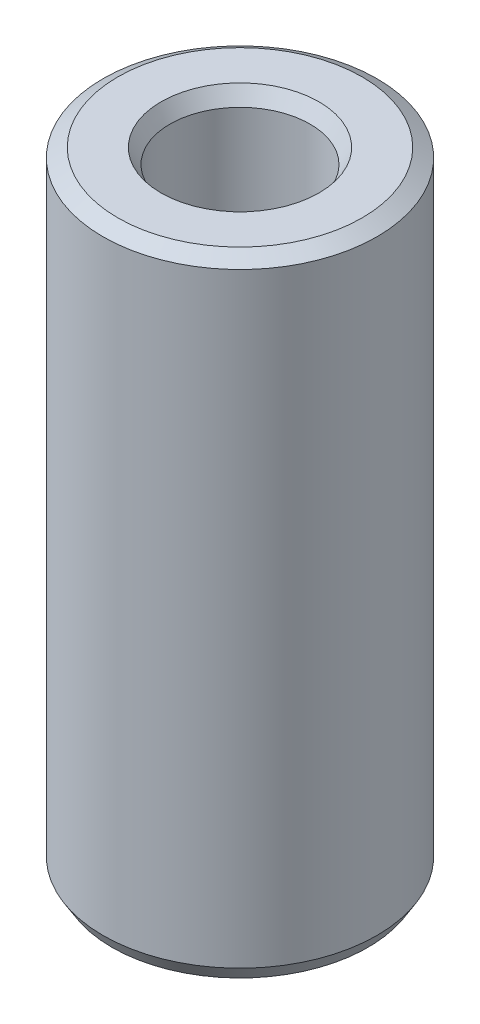
ISO-10303-21;
HEADER;
FILE_DESCRIPTION(('STEP AP214'),'2;1');
FILE_NAME('part.step','',(''),(''),'','','');
FILE_SCHEMA(('AUTOMOTIVE_DESIGN { 1 0 10303 214 1 1 1 1 }'));
ENDSEC;
DATA;
#1=APPLICATION_CONTEXT('core data for automotive mechanical design processes');
#2=APPLICATION_PROTOCOL_DEFINITION('international standard','automotive_design',2000,#1);
#3=PRODUCT_CONTEXT('',#1,'mechanical');
#4=PRODUCT('Part','Part','',(#3));
#5=PRODUCT_RELATED_PRODUCT_CATEGORY('part','',(#4));
#6=PRODUCT_DEFINITION_FORMATION('','',#4);
#7=PRODUCT_DEFINITION_CONTEXT('part definition',#1,'design');
#8=PRODUCT_DEFINITION('design','',#6,#7);
#9=PRODUCT_DEFINITION_SHAPE('','',#8);
#10=(LENGTH_UNIT() NAMED_UNIT(*) SI_UNIT(.MILLI.,.METRE.));
#11=(NAMED_UNIT(*) PLANE_ANGLE_UNIT() SI_UNIT($,.RADIAN.));
#12=(NAMED_UNIT(*) SI_UNIT($,.STERADIAN.) SOLID_ANGLE_UNIT());
#13=UNCERTAINTY_MEASURE_WITH_UNIT(LENGTH_MEASURE(1.E-05),#10,'distance_accuracy_value','');
#14=(GEOMETRIC_REPRESENTATION_CONTEXT(3) GLOBAL_UNCERTAINTY_ASSIGNED_CONTEXT((#13)) GLOBAL_UNIT_ASSIGNED_CONTEXT((#10,
#11,#12)) REPRESENTATION_CONTEXT('',''));
#15=CARTESIAN_POINT('',(0.,0.,0.));
#16=DIRECTION('',(0.,0.,1.));
#17=DIRECTION('',(1.,0.,0.));
#18=AXIS2_PLACEMENT_3D('',#15,#16,#17);
#19=CARTESIAN_POINT('',(0.,34.4353790684563,0.));
#20=DIRECTION('',(0.,-1.,0.));
#21=DIRECTION('',(0.,0.,-1.));
#22=AXIS2_PLACEMENT_3D('',#19,#20,#21);
#23=CYLINDRICAL_SURFACE('',#22,7.5);
#24=CARTESIAN_POINT('',(0.,0.811019928946548,0.));
#25=DIRECTION('',(0.,1.,0.));
#26=DIRECTION('',(0.,0.,1.));
#27=AXIS2_PLACEMENT_3D('',#24,#25,#26);
#28=CIRCLE('',#27,7.5);
#29=CARTESIAN_POINT('',(0.,0.811019928946548,7.5));
#30=VERTEX_POINT('',#29);
#31=EDGE_CURVE('E10',#30,#30,#28,.T.);
#32=ORIENTED_EDGE('',*,*,#31,.T.);
#33=EDGE_LOOP('',(#32));
#34=FACE_BOUND('',#33,.T.);
#35=CARTESIAN_POINT('',(0.,33.9450385827381,0.));
#36=DIRECTION('',(0.,1.,0.));
#37=DIRECTION('',(0.,0.,1.));
#38=AXIS2_PLACEMENT_3D('',#35,#36,#37);
#39=CIRCLE('',#38,7.5);
#40=CARTESIAN_POINT('',(0.,33.9450385827381,7.5));
#41=VERTEX_POINT('',#40);
#42=EDGE_CURVE('E50',#41,#41,#39,.F.);
#43=ORIENTED_EDGE('',*,*,#42,.T.);
#44=EDGE_LOOP('',(#43));
#45=FACE_BOUND('',#44,.T.);
#46=ADVANCED_FACE('F39',(#34,#45),#23,.T.);
#47=CARTESIAN_POINT('',(0.,34.4353790684563,0.));
#48=DIRECTION('',(0.,1.,0.));
#49=DIRECTION('',(0.,0.,1.));
#50=AXIS2_PLACEMENT_3D('',#47,#48,#49);
#51=PLANE('',#50);
#52=CARTESIAN_POINT('',(0.,34.4353790684563,0.));
#53=DIRECTION('',(0.,1.,0.));
#54=DIRECTION('',(0.,0.,1.));
#55=AXIS2_PLACEMENT_3D('',#52,#53,#54);
#56=CIRCLE('',#55,4.32552645235652);
#57=CARTESIAN_POINT('',(0.,34.4353790684563,4.32552645235652));
#58=VERTEX_POINT('',#57);
#59=EDGE_CURVE('E58',#58,#58,#56,.F.);
#60=ORIENTED_EDGE('',*,*,#59,.T.);
#61=EDGE_LOOP('',(#60));
#62=FACE_BOUND('',#61,.T.);
#63=CARTESIAN_POINT('',(0.,34.4353790684563,0.));
#64=DIRECTION('',(0.,1.,0.));
#65=DIRECTION('',(0.,0.,1.));
#66=AXIS2_PLACEMENT_3D('',#63,#64,#65);
#67=CIRCLE('',#66,6.68898007105344);
#68=CARTESIAN_POINT('',(0.,34.4353790684563,6.68898007105344));
#69=VERTEX_POINT('',#68);
#70=EDGE_CURVE('E61',#69,#69,#67,.T.);
#71=ORIENTED_EDGE('',*,*,#70,.T.);
#72=EDGE_LOOP('',(#71));
#73=FACE_BOUND('',#72,.T.);
#74=ADVANCED_FACE('F88',(#62,#73),#51,.T.);
#75=CARTESIAN_POINT('',(0.,0.,0.));
#76=DIRECTION('',(0.,1.,0.));
#77=DIRECTION('',(0.,0.,1.));
#78=AXIS2_PLACEMENT_3D('',#75,#76,#77);
#79=PLANE('',#78);
#80=CARTESIAN_POINT('',(0.,0.,0.));
#81=DIRECTION('',(0.,1.,0.));
#82=DIRECTION('',(0.,0.,1.));
#83=AXIS2_PLACEMENT_3D('',#80,#81,#82);
#84=CIRCLE('',#83,4.64620589558486);
#85=CARTESIAN_POINT('',(0.,0.,4.64620589558486));
#86=VERTEX_POINT('',#85);
#87=EDGE_CURVE('E51',#86,#86,#84,.T.);
#88=ORIENTED_EDGE('',*,*,#87,.T.);
#89=EDGE_LOOP('',(#88));
#90=FACE_BOUND('',#89,.T.);
#91=CARTESIAN_POINT('',(0.,0.,0.));
#92=DIRECTION('',(0.,1.,0.));
#93=DIRECTION('',(0.,0.,1.));
#94=AXIS2_PLACEMENT_3D('',#91,#92,#93);
#95=CIRCLE('',#94,7.00965951428179);
#96=CARTESIAN_POINT('',(0.,0.,7.00965951428179));
#97=VERTEX_POINT('',#96);
#98=EDGE_CURVE('E54',#97,#97,#95,.F.);
#99=ORIENTED_EDGE('',*,*,#98,.T.);
#100=EDGE_LOOP('',(#99));
#101=FACE_BOUND('',#100,.T.);
#102=ADVANCED_FACE('F83',(#90,#101),#79,.F.);
#103=CARTESIAN_POINT('',(0.,34.4353790684563,0.));
#104=DIRECTION('',(0.,-1.,0.));
#105=DIRECTION('',(0.,0.,-1.));
#106=AXIS2_PLACEMENT_3D('',#103,#104,#105);
#107=CYLINDRICAL_SURFACE('',#106,3.83518596663831);
#108=CARTESIAN_POINT('',(0.,33.6243591395098,0.));
#109=DIRECTION('',(0.,1.,0.));
#110=DIRECTION('',(0.,0.,1.));
#111=AXIS2_PLACEMENT_3D('',#108,#109,#110);
#112=CIRCLE('',#111,3.83518596663831);
#113=CARTESIAN_POINT('',(0.,33.6243591395098,3.8351859666383));
#114=VERTEX_POINT('',#113);
#115=EDGE_CURVE('E67',#114,#114,#112,.T.);
#116=ORIENTED_EDGE('',*,*,#115,.T.);
#117=EDGE_LOOP('',(#116));
#118=FACE_BOUND('',#117,.T.);
#119=CARTESIAN_POINT('',(0.,0.490340485718221,0.));
#120=DIRECTION('',(0.,1.,0.));
#121=DIRECTION('',(0.,0.,1.));
#122=AXIS2_PLACEMENT_3D('',#119,#120,#121);
#123=CIRCLE('',#122,3.83518596663831);
#124=CARTESIAN_POINT('',(0.,0.490340485718221,3.83518596663831));
#125=VERTEX_POINT('',#124);
#126=EDGE_CURVE('E69',#125,#125,#123,.F.);
#127=ORIENTED_EDGE('',*,*,#126,.T.);
#128=EDGE_LOOP('',(#127));
#129=FACE_BOUND('',#128,.T.);
#130=ADVANCED_FACE('F71',(#118,#129),#107,.F.);
#131=CARTESIAN_POINT('',(0.,33.6243591395098,0.));
#132=DIRECTION('',(0.,1.,0.));
#133=DIRECTION('',(0.,0.,1.));
#134=AXIS2_PLACEMENT_3D('',#131,#132,#133);
#135=CONICAL_SURFACE('',#134,3.83518596663831,0.543793036732277);
#136=CARTESIAN_POINT('',(0.,34.4353790684563,4.32552645235652));
#137=CARTESIAN_POINT('',(0.,34.4269309441965,4.32041873896362));
#138=CARTESIAN_POINT('',(0.,34.4184828199366,4.31531102557072));
#139=CARTESIAN_POINT('',(0.,34.4015865714169,4.30509559878493));
#140=CARTESIAN_POINT('',(0.,34.393138447157,4.29998788539203));
#141=CARTESIAN_POINT('',(0.,34.3762421986373,4.28977245860623));
#142=CARTESIAN_POINT('',(0.,34.3677940743774,4.28466474521334));
#143=CARTESIAN_POINT('',(0.,34.3508978258577,4.27444931842754));
#144=CARTESIAN_POINT('',(0.,34.3424497015979,4.26934160503464));
#145=CARTESIAN_POINT('',(0.,34.3255534530781,4.25912617824885));
#146=CARTESIAN_POINT('',(0.,34.3171053288183,4.25401846485595));
#147=CARTESIAN_POINT('',(0.,34.3002090802986,4.24380303807015));
#148=CARTESIAN_POINT('',(0.,34.2917609560387,4.23869532467725));
#149=CARTESIAN_POINT('',(0.,34.274864707519,4.22847989789146));
#150=CARTESIAN_POINT('',(0.,34.2664165832591,4.22337218449856));
#151=CARTESIAN_POINT('',(0.,34.2495203347394,4.21315675771276));
#152=CARTESIAN_POINT('',(0.,34.2410722104795,4.20804904431987));
#153=CARTESIAN_POINT('',(0.,34.2241759619598,4.19783361753407));
#154=CARTESIAN_POINT('',(0.,34.2157278377,4.19272590414117));
#155=CARTESIAN_POINT('',(0.,34.1988315891802,4.18251047735538));
#156=CARTESIAN_POINT('',(0.,34.1903834649204,4.17740276396248));
#157=CARTESIAN_POINT('',(0.,34.1734872164007,4.16718733717668));
#158=CARTESIAN_POINT('',(0.,34.1650390921408,4.16207962378378));
#159=CARTESIAN_POINT('',(0.,34.1481428436211,4.15186419699799));
#160=CARTESIAN_POINT('',(0.,34.1396947193612,4.14675648360509));
#161=CARTESIAN_POINT('',(0.,34.1227984708415,4.13654105681929));
#162=CARTESIAN_POINT('',(0.,34.1143503465816,4.13143334342639));
#163=CARTESIAN_POINT('',(0.,34.0974540980619,4.1212179166406));
#164=CARTESIAN_POINT('',(0.,34.0890059738021,4.1161102032477));
#165=CARTESIAN_POINT('',(0.,34.0721097252823,4.1058947764619));
#166=CARTESIAN_POINT('',(0.,34.0636616010225,4.100787063069));
#167=CARTESIAN_POINT('',(0.,34.0467653525028,4.09057163628321));
#168=CARTESIAN_POINT('',(0.,34.0383172282429,4.08546392289031));
#169=CARTESIAN_POINT('',(0.,34.0214209797232,4.07524849610451));
#170=CARTESIAN_POINT('',(0.,34.0129728554633,4.07014078271162));
#171=CARTESIAN_POINT('',(0.,33.9960766069436,4.05992535592582));
#172=CARTESIAN_POINT('',(0.,33.9876284826837,4.05481764253292));
#173=CARTESIAN_POINT('',(0.,33.970732234164,4.04460221574713));
#174=CARTESIAN_POINT('',(0.,33.9622841099042,4.03949450235423));
#175=CARTESIAN_POINT('',(0.,33.9453878613844,4.02927907556843));
#176=CARTESIAN_POINT('',(0.,33.9369397371246,4.02417136217553));
#177=CARTESIAN_POINT('',(0.,33.9200434886049,4.01395593538974));
#178=CARTESIAN_POINT('',(0.,33.911595364345,4.00884822199684));
#179=CARTESIAN_POINT('',(0.,33.8946991158253,3.99863279521104));
#180=CARTESIAN_POINT('',(0.,33.8862509915654,3.99352508181815));
#181=CARTESIAN_POINT('',(0.,33.8693547430457,3.98330965503235));
#182=CARTESIAN_POINT('',(0.,33.8609066187858,3.97820194163945));
#183=CARTESIAN_POINT('',(0.,33.8440103702661,3.96798651485365));
#184=CARTESIAN_POINT('',(0.,33.8355622460063,3.96287880146076));
#185=CARTESIAN_POINT('',(0.,33.8186659974865,3.95266337467496));
#186=CARTESIAN_POINT('',(0.,33.8102178732267,3.94755566128206));
#187=CARTESIAN_POINT('',(0.,33.793321624707,3.93734023449627));
#188=CARTESIAN_POINT('',(0.,33.7848735004471,3.93223252110337));
#189=CARTESIAN_POINT('',(0.,33.7679772519274,3.92201709431757));
#190=CARTESIAN_POINT('',(0.,33.7595291276675,3.91690938092467));
#191=CARTESIAN_POINT('',(0.,33.7426328791478,3.90669395413888));
#192=CARTESIAN_POINT('',(0.,33.7341847548879,3.90158624074598));
#193=CARTESIAN_POINT('',(0.,33.7172885063682,3.89137081396018));
#194=CARTESIAN_POINT('',(0.,33.7088403821084,3.88626310056728));
#195=CARTESIAN_POINT('',(0.,33.6919441335886,3.87604767378149));
#196=CARTESIAN_POINT('',(0.,33.6834960093288,3.87093996038859));
#197=CARTESIAN_POINT('',(0.,33.6665997608091,3.86072453360279));
#198=CARTESIAN_POINT('',(0.,33.6581516365492,3.8556168202099));
#199=CARTESIAN_POINT('',(0.,33.6412553880295,3.8454013934241));
#200=CARTESIAN_POINT('',(0.,33.6328072637696,3.8402936800312));
#201=CARTESIAN_POINT('',(0.,33.6243591395098,3.8351859666383));
#202=B_SPLINE_CURVE_WITH_KNOTS('',3,(#136,#137,#138,#139,#140,#141,#142,#143,#144,#145,#146,
#147,#148,#149,#150,#151,#152,#153,#154,#155,#156,#157,#158,#159,#160,#161,#162,#163,#164,#165,
#166,#167,#168,#169,#170,#171,#172,#173,#174,#175,#176,#177,#178,#179,#180,#181,#182,#183,#184,
#185,#186,#187,#188,#189,#190,#191,#192,#193,#194,#195,#196,#197,#198,#199,#200,#201),
.UNSPECIFIED.,.F.,.F.,(4,2,2,2,2,2,2,2,2,2,2,2,2,2,2,2,2,2,2,2,2,2,2,2,2,2,2,2,2,2,2,2,4),(0.,
0.0296164794755549,0.0592329589511157,0.0888494384266765,0.118465917902237,0.148082397377792,
0.177698876853353,0.207315356328913,0.236931835804474,0.266548315280035,0.29616479475559,
0.325781274231151,0.355397753706711,0.385014233182272,0.414630712657827,0.444247192133387,
0.473863671608948,0.503480151084509,0.53309663056007,0.562713110035625,0.592329589511186,
0.621946068986746,0.651562548462307,0.681179027937862,0.710795507413422,0.740411986888983,
0.770028466364544,0.799644945840105,0.829261425315659,0.85887790479122,0.888494384266781,
0.918110863742342,0.947727343217897),.UNSPECIFIED.);
#203=EDGE_CURVE('BSEAM77',#58,#114,#202,.T.);
#204=ORIENTED_EDGE('',*,*,#59,.F.);
#205=ORIENTED_EDGE('',*,*,#115,.F.);
#206=ORIENTED_EDGE('',*,*,#203,.T.);
#207=ORIENTED_EDGE('',*,*,#203,.F.);
#208=EDGE_LOOP('',(#204,#206,#205,#207));
#209=FACE_BOUND('',#208,.T.);
#210=ADVANCED_FACE('F77',(#209),#135,.F.);
#211=CARTESIAN_POINT('',(0.,0.,0.));
#212=DIRECTION('',(0.,-1.,0.));
#213=DIRECTION('',(0.,0.,-1.));
#214=AXIS2_PLACEMENT_3D('',#211,#212,#213);
#215=CONICAL_SURFACE('',#214,4.64620589558486,1.02700329006261);
#216=ORIENTED_EDGE('',*,*,#126,.F.);
#217=EDGE_LOOP('',(#216));
#218=FACE_BOUND('',#217,.T.);
#219=ORIENTED_EDGE('',*,*,#87,.F.);
#220=EDGE_LOOP('',(#219));
#221=FACE_BOUND('',#220,.T.);
#222=ADVANCED_FACE('F73',(#218,#221),#215,.F.);
#223=CARTESIAN_POINT('',(0.,0.811019928946548,0.));
#224=DIRECTION('',(0.,1.,0.));
#225=DIRECTION('',(0.,0.,1.));
#226=AXIS2_PLACEMENT_3D('',#223,#224,#225);
#227=CONICAL_SURFACE('',#226,7.5,0.543793036732281);
#228=ORIENTED_EDGE('',*,*,#98,.F.);
#229=EDGE_LOOP('',(#228));
#230=FACE_BOUND('',#229,.T.);
#231=ORIENTED_EDGE('',*,*,#31,.F.);
#232=EDGE_LOOP('',(#231));
#233=FACE_BOUND('',#232,.T.);
#234=ADVANCED_FACE('F76',(#230,#233),#227,.T.);
#235=CARTESIAN_POINT('',(0.,34.4353790684563,0.));
#236=DIRECTION('',(0.,-1.,0.));
#237=DIRECTION('',(0.,0.,-1.));
#238=AXIS2_PLACEMENT_3D('',#235,#236,#237);
#239=CONICAL_SURFACE('',#238,6.68898007105344,1.02700329006262);
#240=ORIENTED_EDGE('',*,*,#42,.F.);
#241=EDGE_LOOP('',(#240));
#242=FACE_BOUND('',#241,.T.);
#243=ORIENTED_EDGE('',*,*,#70,.F.);
#244=EDGE_LOOP('',(#243));
#245=FACE_BOUND('',#244,.T.);
#246=ADVANCED_FACE('F45',(#242,#245),#239,.T.);
#247=CLOSED_SHELL('',(#46,#74,#102,#130,#210,#222,#234,#246));
#248=MANIFOLD_SOLID_BREP('B2',#247);
#249=ADVANCED_BREP_SHAPE_REPRESENTATION('',(#18,#248),#14);
#250=SHAPE_DEFINITION_REPRESENTATION(#9,#249);
ENDSEC;
END-ISO-10303-21;
